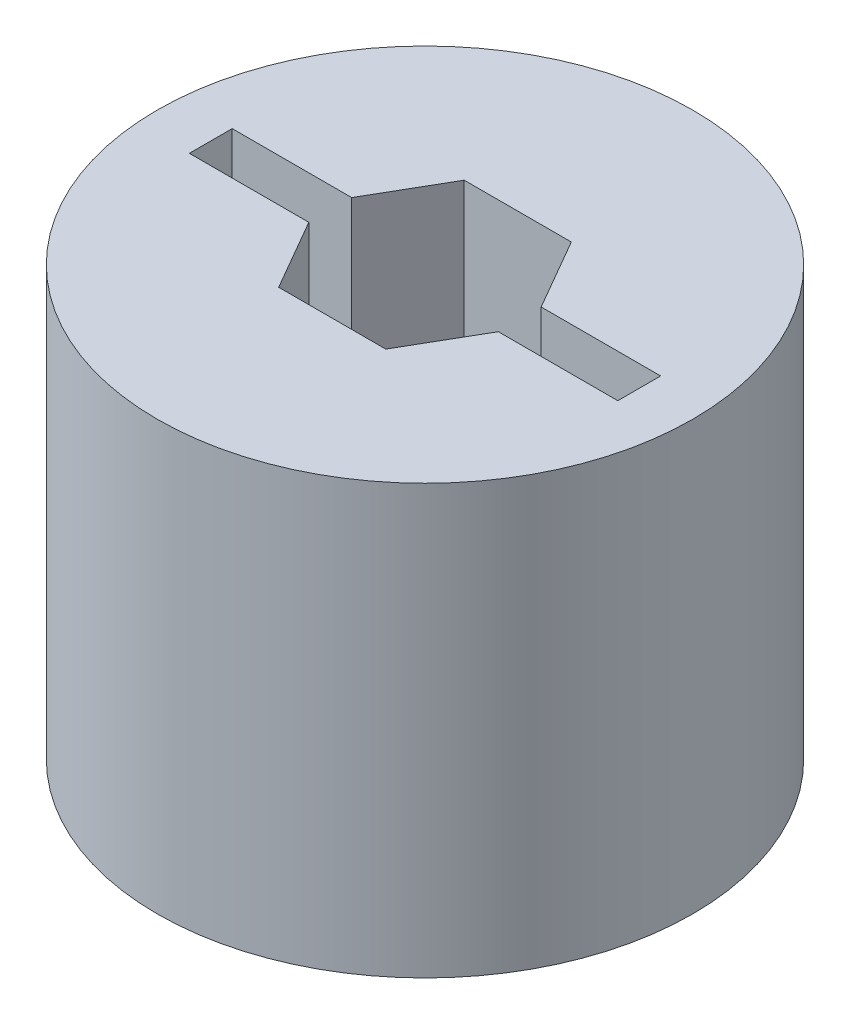
ISO-10303-21;
HEADER;
FILE_DESCRIPTION(('STEP AP214'),'2;1');
FILE_NAME('part.step','',(''),(''),'','','');
FILE_SCHEMA(('AUTOMOTIVE_DESIGN { 1 0 10303 214 1 1 1 1 }'));
ENDSEC;
DATA;
#1=APPLICATION_CONTEXT('core data for automotive mechanical design processes');
#2=APPLICATION_PROTOCOL_DEFINITION('international standard','automotive_design',2000,#1);
#3=PRODUCT_CONTEXT('',#1,'mechanical');
#4=PRODUCT('Part','Part','',(#3));
#5=PRODUCT_RELATED_PRODUCT_CATEGORY('part','',(#4));
#6=PRODUCT_DEFINITION_FORMATION('','',#4);
#7=PRODUCT_DEFINITION_CONTEXT('part definition',#1,'design');
#8=PRODUCT_DEFINITION('design','',#6,#7);
#9=PRODUCT_DEFINITION_SHAPE('','',#8);
#10=(LENGTH_UNIT() NAMED_UNIT(*) SI_UNIT(.MILLI.,.METRE.));
#11=(NAMED_UNIT(*) PLANE_ANGLE_UNIT() SI_UNIT($,.RADIAN.));
#12=(NAMED_UNIT(*) SI_UNIT($,.STERADIAN.) SOLID_ANGLE_UNIT());
#13=UNCERTAINTY_MEASURE_WITH_UNIT(LENGTH_MEASURE(1.E-05),#10,'distance_accuracy_value','');
#14=(GEOMETRIC_REPRESENTATION_CONTEXT(3) GLOBAL_UNCERTAINTY_ASSIGNED_CONTEXT((#13)) GLOBAL_UNIT_ASSIGNED_CONTEXT((#10,
#11,#12)) REPRESENTATION_CONTEXT('',''));
#15=CARTESIAN_POINT('',(0.,0.,0.));
#16=DIRECTION('',(0.,0.,1.));
#17=DIRECTION('',(1.,0.,0.));
#18=AXIS2_PLACEMENT_3D('',#15,#16,#17);
#19=CARTESIAN_POINT('',(0.,25.4,0.));
#20=DIRECTION('',(0.,-1.,0.));
#21=DIRECTION('',(0.,0.,-1.));
#22=AXIS2_PLACEMENT_3D('',#19,#20,#21);
#23=CYLINDRICAL_SURFACE('',#22,15.875);
#24=CARTESIAN_POINT('',(0.,25.4,0.));
#25=DIRECTION('',(0.,1.,0.));
#26=DIRECTION('',(0.,0.,1.));
#27=AXIS2_PLACEMENT_3D('',#24,#25,#26);
#28=CIRCLE('',#27,15.875);
#29=CARTESIAN_POINT('',(0.,25.4,15.875));
#30=VERTEX_POINT('',#29);
#31=EDGE_CURVE('E11',#30,#30,#28,.T.);
#32=ORIENTED_EDGE('',*,*,#31,.F.);
#33=EDGE_LOOP('',(#32));
#34=FACE_BOUND('',#33,.T.);
#35=CARTESIAN_POINT('',(0.,0.,0.));
#36=DIRECTION('',(0.,1.,0.));
#37=DIRECTION('',(0.,0.,1.));
#38=AXIS2_PLACEMENT_3D('',#35,#36,#37);
#39=CIRCLE('',#38,15.875);
#40=CARTESIAN_POINT('',(0.,0.,15.875));
#41=VERTEX_POINT('',#40);
#42=EDGE_CURVE('E35',#41,#41,#39,.T.);
#43=ORIENTED_EDGE('',*,*,#42,.T.);
#44=EDGE_LOOP('',(#43));
#45=FACE_BOUND('',#44,.T.);
#46=ADVANCED_FACE('F32',(#34,#45),#23,.T.);
#47=CARTESIAN_POINT('',(0.,25.4,0.));
#48=DIRECTION('',(0.,1.,0.));
#49=DIRECTION('',(0.,0.,1.));
#50=AXIS2_PLACEMENT_3D('',#47,#48,#49);
#51=PLANE('',#50);
#52=DIRECTION('',(1.,0.,0.));
#53=VECTOR('',#52,1.);
#54=CARTESIAN_POINT('',(0.,25.4,1.27));
#55=LINE('',#54,#53);
#56=CARTESIAN_POINT('',(-12.7,25.4,1.27));
#57=VERTEX_POINT('',#56);
#58=CARTESIAN_POINT('',(-5.61676515812917,25.4,1.27));
#59=VERTEX_POINT('',#58);
#60=EDGE_CURVE('E46',#57,#59,#55,.T.);
#61=ORIENTED_EDGE('',*,*,#60,.F.);
#62=DIRECTION('',(0.,0.,-1.));
#63=VECTOR('',#62,1.);
#64=CARTESIAN_POINT('',(-12.7,25.4,0.));
#65=LINE('',#64,#63);
#66=CARTESIAN_POINT('',(-12.7,25.4,-1.27));
#67=VERTEX_POINT('',#66);
#68=EDGE_CURVE('E138',#57,#67,#65,.T.);
#69=ORIENTED_EDGE('',*,*,#68,.T.);
#70=DIRECTION('',(1.,0.,0.));
#71=VECTOR('',#70,1.);
#72=CARTESIAN_POINT('',(0.,25.4,-1.27));
#73=LINE('',#72,#71);
#74=CARTESIAN_POINT('',(-5.61676515812917,25.4,-1.27));
#75=VERTEX_POINT('',#74);
#76=EDGE_CURVE('E141',#67,#75,#73,.T.);
#77=ORIENTED_EDGE('',*,*,#76,.T.);
#78=DIRECTION('',(-0.5,0.,0.866025403784439));
#79=VECTOR('',#78,1.);
#80=CARTESIAN_POINT('',(-4.7625,25.4,-2.74963065701559));
#81=LINE('',#80,#79);
#82=CARTESIAN_POINT('',(-3.175,25.4,-5.49926131403118));
#83=VERTEX_POINT('',#82);
#84=EDGE_CURVE('E192',#83,#75,#81,.T.);
#85=ORIENTED_EDGE('',*,*,#84,.F.);
#86=DIRECTION('',(-1.,0.,0.));
#87=VECTOR('',#86,1.);
#88=CARTESIAN_POINT('',(0.,25.4,-5.49926131403118));
#89=LINE('',#88,#87);
#90=CARTESIAN_POINT('',(3.175,25.4,-5.49926131403118));
#91=VERTEX_POINT('',#90);
#92=EDGE_CURVE('E189',#91,#83,#89,.T.);
#93=ORIENTED_EDGE('',*,*,#92,.F.);
#94=DIRECTION('',(-0.5,0.,-0.866025403784439));
#95=VECTOR('',#94,1.);
#96=CARTESIAN_POINT('',(4.7625,25.4,-2.74963065701559));
#97=LINE('',#96,#95);
#98=CARTESIAN_POINT('',(5.61676515812917,25.4,-1.27));
#99=VERTEX_POINT('',#98);
#100=EDGE_CURVE('E186',#99,#91,#97,.T.);
#101=ORIENTED_EDGE('',*,*,#100,.F.);
#102=DIRECTION('',(1.,0.,0.));
#103=VECTOR('',#102,1.);
#104=CARTESIAN_POINT('',(0.,25.4,-1.27));
#105=LINE('',#104,#103);
#106=CARTESIAN_POINT('',(12.7,25.4,-1.27));
#107=VERTEX_POINT('',#106);
#108=EDGE_CURVE('E183',#99,#107,#105,.T.);
#109=ORIENTED_EDGE('',*,*,#108,.T.);
#110=DIRECTION('',(0.,0.,-1.));
#111=VECTOR('',#110,1.);
#112=CARTESIAN_POINT('',(12.7,25.4,0.));
#113=LINE('',#112,#111);
#114=CARTESIAN_POINT('',(12.7,25.4,1.27));
#115=VERTEX_POINT('',#114);
#116=EDGE_CURVE('E180',#115,#107,#113,.T.);
#117=ORIENTED_EDGE('',*,*,#116,.F.);
#118=DIRECTION('',(1.,0.,0.));
#119=VECTOR('',#118,1.);
#120=CARTESIAN_POINT('',(0.,25.4,1.27));
#121=LINE('',#120,#119);
#122=CARTESIAN_POINT('',(5.61676515812917,25.4,1.27));
#123=VERTEX_POINT('',#122);
#124=EDGE_CURVE('E177',#123,#115,#121,.T.);
#125=ORIENTED_EDGE('',*,*,#124,.F.);
#126=DIRECTION('',(0.5,0.,-0.866025403784439));
#127=VECTOR('',#126,1.);
#128=CARTESIAN_POINT('',(4.7625,25.4,2.74963065701559));
#129=LINE('',#128,#127);
#130=CARTESIAN_POINT('',(3.175,25.4,5.49926131403118));
#131=VERTEX_POINT('',#130);
#132=EDGE_CURVE('E174',#131,#123,#129,.T.);
#133=ORIENTED_EDGE('',*,*,#132,.F.);
#134=DIRECTION('',(1.,0.,0.));
#135=VECTOR('',#134,1.);
#136=CARTESIAN_POINT('',(0.,25.4,5.49926131403118));
#137=LINE('',#136,#135);
#138=CARTESIAN_POINT('',(-3.175,25.4,5.49926131403118));
#139=VERTEX_POINT('',#138);
#140=EDGE_CURVE('E171',#139,#131,#137,.T.);
#141=ORIENTED_EDGE('',*,*,#140,.F.);
#142=DIRECTION('',(0.5,0.,0.866025403784439));
#143=VECTOR('',#142,1.);
#144=CARTESIAN_POINT('',(-4.7625,25.4,2.74963065701559));
#145=LINE('',#144,#143);
#146=EDGE_CURVE('E169',#59,#139,#145,.T.);
#147=ORIENTED_EDGE('',*,*,#146,.F.);
#148=EDGE_LOOP('',(#61,#69,#77,#85,#93,#101,#109,#117,#125,#133,#141,#147));
#149=FACE_BOUND('',#148,.T.);
#150=ORIENTED_EDGE('',*,*,#31,.T.);
#151=EDGE_LOOP('',(#150));
#152=FACE_BOUND('',#151,.T.);
#153=ADVANCED_FACE('F221',(#149,#152),#51,.T.);
#154=CARTESIAN_POINT('',(0.,0.,0.));
#155=DIRECTION('',(0.,1.,0.));
#156=DIRECTION('',(0.,0.,1.));
#157=AXIS2_PLACEMENT_3D('',#154,#155,#156);
#158=PLANE('',#157);
#159=DIRECTION('',(0.,0.,-1.));
#160=VECTOR('',#159,1.);
#161=CARTESIAN_POINT('',(-12.7,0.,0.));
#162=LINE('',#161,#160);
#163=CARTESIAN_POINT('',(-12.7,0.,1.27));
#164=VERTEX_POINT('',#163);
#165=CARTESIAN_POINT('',(-12.7,0.,-1.27));
#166=VERTEX_POINT('',#165);
#167=EDGE_CURVE('E128',#164,#166,#162,.T.);
#168=ORIENTED_EDGE('',*,*,#167,.F.);
#169=DIRECTION('',(1.,0.,0.));
#170=VECTOR('',#169,1.);
#171=CARTESIAN_POINT('',(0.,0.,1.27));
#172=LINE('',#171,#170);
#173=CARTESIAN_POINT('',(-5.61676515812917,0.,1.27));
#174=VERTEX_POINT('',#173);
#175=EDGE_CURVE('E122',#164,#174,#172,.T.);
#176=ORIENTED_EDGE('',*,*,#175,.T.);
#177=DIRECTION('',(0.5,0.,0.866025403784439));
#178=VECTOR('',#177,1.);
#179=CARTESIAN_POINT('',(-4.7625,0.,2.74963065701559));
#180=LINE('',#179,#178);
#181=CARTESIAN_POINT('',(-3.175,0.,5.49926131403118));
#182=VERTEX_POINT('',#181);
#183=EDGE_CURVE('E131',#174,#182,#180,.T.);
#184=ORIENTED_EDGE('',*,*,#183,.T.);
#185=DIRECTION('',(1.,0.,0.));
#186=VECTOR('',#185,1.);
#187=CARTESIAN_POINT('',(0.,0.,5.49926131403118));
#188=LINE('',#187,#186);
#189=CARTESIAN_POINT('',(3.175,0.,5.49926131403118));
#190=VERTEX_POINT('',#189);
#191=EDGE_CURVE('E54',#182,#190,#188,.T.);
#192=ORIENTED_EDGE('',*,*,#191,.T.);
#193=DIRECTION('',(0.5,0.,-0.866025403784439));
#194=VECTOR('',#193,1.);
#195=CARTESIAN_POINT('',(4.7625,0.,2.74963065701559));
#196=LINE('',#195,#194);
#197=CARTESIAN_POINT('',(5.61676515812917,0.,1.27));
#198=VERTEX_POINT('',#197);
#199=EDGE_CURVE('E145',#190,#198,#196,.T.);
#200=ORIENTED_EDGE('',*,*,#199,.T.);
#201=DIRECTION('',(1.,0.,0.));
#202=VECTOR('',#201,1.);
#203=CARTESIAN_POINT('',(0.,0.,1.27));
#204=LINE('',#203,#202);
#205=CARTESIAN_POINT('',(12.7,0.,1.27));
#206=VERTEX_POINT('',#205);
#207=EDGE_CURVE('E148',#198,#206,#204,.T.);
#208=ORIENTED_EDGE('',*,*,#207,.T.);
#209=DIRECTION('',(0.,0.,-1.));
#210=VECTOR('',#209,1.);
#211=CARTESIAN_POINT('',(12.7,0.,0.));
#212=LINE('',#211,#210);
#213=CARTESIAN_POINT('',(12.7,0.,-1.27));
#214=VERTEX_POINT('',#213);
#215=EDGE_CURVE('E151',#206,#214,#212,.T.);
#216=ORIENTED_EDGE('',*,*,#215,.T.);
#217=DIRECTION('',(1.,0.,0.));
#218=VECTOR('',#217,1.);
#219=CARTESIAN_POINT('',(0.,0.,-1.27));
#220=LINE('',#219,#218);
#221=CARTESIAN_POINT('',(5.61676515812917,0.,-1.27));
#222=VERTEX_POINT('',#221);
#223=EDGE_CURVE('E154',#222,#214,#220,.T.);
#224=ORIENTED_EDGE('',*,*,#223,.F.);
#225=DIRECTION('',(-0.5,0.,-0.866025403784439));
#226=VECTOR('',#225,1.);
#227=CARTESIAN_POINT('',(4.7625,0.,-2.74963065701559));
#228=LINE('',#227,#226);
#229=CARTESIAN_POINT('',(3.175,0.,-5.49926131403118));
#230=VERTEX_POINT('',#229);
#231=EDGE_CURVE('E156',#222,#230,#228,.T.);
#232=ORIENTED_EDGE('',*,*,#231,.T.);
#233=DIRECTION('',(-1.,0.,0.));
#234=VECTOR('',#233,1.);
#235=CARTESIAN_POINT('',(0.,0.,-5.49926131403118));
#236=LINE('',#235,#234);
#237=CARTESIAN_POINT('',(-3.175,0.,-5.49926131403118));
#238=VERTEX_POINT('',#237);
#239=EDGE_CURVE('E159',#230,#238,#236,.T.);
#240=ORIENTED_EDGE('',*,*,#239,.T.);
#241=DIRECTION('',(-0.5,0.,0.866025403784439));
#242=VECTOR('',#241,1.);
#243=CARTESIAN_POINT('',(-4.7625,0.,-2.74963065701559));
#244=LINE('',#243,#242);
#245=CARTESIAN_POINT('',(-5.61676515812917,0.,-1.27));
#246=VERTEX_POINT('',#245);
#247=EDGE_CURVE('E162',#238,#246,#244,.T.);
#248=ORIENTED_EDGE('',*,*,#247,.T.);
#249=DIRECTION('',(1.,0.,0.));
#250=VECTOR('',#249,1.);
#251=CARTESIAN_POINT('',(0.,0.,-1.27));
#252=LINE('',#251,#250);
#253=EDGE_CURVE('E165',#166,#246,#252,.T.);
#254=ORIENTED_EDGE('',*,*,#253,.F.);
#255=EDGE_LOOP('',(#168,#176,#184,#192,#200,#208,#216,#224,#232,#240,#248,#254));
#256=FACE_BOUND('',#255,.T.);
#257=ORIENTED_EDGE('',*,*,#42,.F.);
#258=EDGE_LOOP('',(#257));
#259=FACE_BOUND('',#258,.T.);
#260=ADVANCED_FACE('F135',(#256,#259),#158,.F.);
#261=CARTESIAN_POINT('',(0.,0.,1.27));
#262=DIRECTION('',(0.,0.,1.));
#263=DIRECTION('',(1.,0.,0.));
#264=AXIS2_PLACEMENT_3D('',#261,#262,#263);
#265=PLANE('',#264);
#266=ORIENTED_EDGE('',*,*,#60,.T.);
#267=DIRECTION('',(0.,1.,0.));
#268=VECTOR('',#267,1.);
#269=CARTESIAN_POINT('',(-5.61676515812917,0.,1.27));
#270=LINE('',#269,#268);
#271=EDGE_CURVE('E118',#174,#59,#270,.T.);
#272=ORIENTED_EDGE('',*,*,#271,.F.);
#273=ORIENTED_EDGE('',*,*,#175,.F.);
#274=DIRECTION('',(0.,1.,0.));
#275=VECTOR('',#274,1.);
#276=CARTESIAN_POINT('',(-12.7,0.,1.27));
#277=LINE('',#276,#275);
#278=EDGE_CURVE('E197',#164,#57,#277,.T.);
#279=ORIENTED_EDGE('',*,*,#278,.T.);
#280=EDGE_LOOP('',(#266,#272,#273,#279));
#281=FACE_BOUND('',#280,.T.);
#282=ADVANCED_FACE('F120',(#281),#265,.F.);
#283=CARTESIAN_POINT('',(-12.7,0.,0.));
#284=DIRECTION('',(1.,0.,0.));
#285=DIRECTION('',(0.,0.,-1.));
#286=AXIS2_PLACEMENT_3D('',#283,#284,#285);
#287=PLANE('',#286);
#288=ORIENTED_EDGE('',*,*,#68,.F.);
#289=ORIENTED_EDGE('',*,*,#278,.F.);
#290=ORIENTED_EDGE('',*,*,#167,.T.);
#291=DIRECTION('',(0.,1.,0.));
#292=VECTOR('',#291,1.);
#293=CARTESIAN_POINT('',(-12.7,0.,-1.27));
#294=LINE('',#293,#292);
#295=EDGE_CURVE('E199',#166,#67,#294,.T.);
#296=ORIENTED_EDGE('',*,*,#295,.T.);
#297=EDGE_LOOP('',(#288,#289,#290,#296));
#298=FACE_BOUND('',#297,.T.);
#299=ADVANCED_FACE('F258',(#298),#287,.T.);
#300=CARTESIAN_POINT('',(0.,0.,-1.27));
#301=DIRECTION('',(0.,0.,1.));
#302=DIRECTION('',(1.,0.,0.));
#303=AXIS2_PLACEMENT_3D('',#300,#301,#302);
#304=PLANE('',#303);
#305=ORIENTED_EDGE('',*,*,#76,.F.);
#306=ORIENTED_EDGE('',*,*,#295,.F.);
#307=ORIENTED_EDGE('',*,*,#253,.T.);
#308=DIRECTION('',(0.,1.,0.));
#309=VECTOR('',#308,1.);
#310=CARTESIAN_POINT('',(-5.61676515812917,0.,-1.27));
#311=LINE('',#310,#309);
#312=EDGE_CURVE('E201',#246,#75,#311,.T.);
#313=ORIENTED_EDGE('',*,*,#312,.T.);
#314=EDGE_LOOP('',(#305,#306,#307,#313));
#315=FACE_BOUND('',#314,.T.);
#316=ADVANCED_FACE('F255',(#315),#304,.T.);
#317=CARTESIAN_POINT('',(-4.7625,0.,-2.74963065701559));
#318=DIRECTION('',(-0.866025403784439,0.,-0.5));
#319=DIRECTION('',(-0.5,0.,0.866025403784439));
#320=AXIS2_PLACEMENT_3D('',#317,#318,#319);
#321=PLANE('',#320);
#322=ORIENTED_EDGE('',*,*,#84,.T.);
#323=ORIENTED_EDGE('',*,*,#312,.F.);
#324=ORIENTED_EDGE('',*,*,#247,.F.);
#325=DIRECTION('',(0.,1.,0.));
#326=VECTOR('',#325,1.);
#327=CARTESIAN_POINT('',(-3.175,0.,-5.49926131403118));
#328=LINE('',#327,#326);
#329=EDGE_CURVE('E203',#238,#83,#328,.T.);
#330=ORIENTED_EDGE('',*,*,#329,.T.);
#331=EDGE_LOOP('',(#322,#323,#324,#330));
#332=FACE_BOUND('',#331,.T.);
#333=ADVANCED_FACE('F251',(#332),#321,.F.);
#334=CARTESIAN_POINT('',(0.,0.,-5.49926131403118));
#335=DIRECTION('',(0.,0.,-1.));
#336=DIRECTION('',(-1.,0.,0.));
#337=AXIS2_PLACEMENT_3D('',#334,#335,#336);
#338=PLANE('',#337);
#339=ORIENTED_EDGE('',*,*,#92,.T.);
#340=ORIENTED_EDGE('',*,*,#329,.F.);
#341=ORIENTED_EDGE('',*,*,#239,.F.);
#342=DIRECTION('',(0.,1.,0.));
#343=VECTOR('',#342,1.);
#344=CARTESIAN_POINT('',(3.175,0.,-5.49926131403118));
#345=LINE('',#344,#343);
#346=EDGE_CURVE('E205',#230,#91,#345,.T.);
#347=ORIENTED_EDGE('',*,*,#346,.T.);
#348=EDGE_LOOP('',(#339,#340,#341,#347));
#349=FACE_BOUND('',#348,.T.);
#350=ADVANCED_FACE('F246',(#349),#338,.F.);
#351=CARTESIAN_POINT('',(4.7625,0.,-2.74963065701559));
#352=DIRECTION('',(0.866025403784438,0.,-0.5));
#353=DIRECTION('',(-0.5,0.,-0.866025403784439));
#354=AXIS2_PLACEMENT_3D('',#351,#352,#353);
#355=PLANE('',#354);
#356=ORIENTED_EDGE('',*,*,#100,.T.);
#357=ORIENTED_EDGE('',*,*,#346,.F.);
#358=ORIENTED_EDGE('',*,*,#231,.F.);
#359=DIRECTION('',(0.,1.,0.));
#360=VECTOR('',#359,1.);
#361=CARTESIAN_POINT('',(5.61676515812917,0.,-1.27));
#362=LINE('',#361,#360);
#363=EDGE_CURVE('E207',#222,#99,#362,.T.);
#364=ORIENTED_EDGE('',*,*,#363,.T.);
#365=EDGE_LOOP('',(#356,#357,#358,#364));
#366=FACE_BOUND('',#365,.T.);
#367=ADVANCED_FACE('F243',(#366),#355,.F.);
#368=CARTESIAN_POINT('',(0.,0.,-1.27));
#369=DIRECTION('',(0.,0.,1.));
#370=DIRECTION('',(1.,0.,0.));
#371=AXIS2_PLACEMENT_3D('',#368,#369,#370);
#372=PLANE('',#371);
#373=ORIENTED_EDGE('',*,*,#108,.F.);
#374=ORIENTED_EDGE('',*,*,#363,.F.);
#375=ORIENTED_EDGE('',*,*,#223,.T.);
#376=DIRECTION('',(0.,1.,0.));
#377=VECTOR('',#376,1.);
#378=CARTESIAN_POINT('',(12.7,0.,-1.27));
#379=LINE('',#378,#377);
#380=EDGE_CURVE('E209',#214,#107,#379,.T.);
#381=ORIENTED_EDGE('',*,*,#380,.T.);
#382=EDGE_LOOP('',(#373,#374,#375,#381));
#383=FACE_BOUND('',#382,.T.);
#384=ADVANCED_FACE('F238',(#383),#372,.T.);
#385=CARTESIAN_POINT('',(12.7,0.,0.));
#386=DIRECTION('',(1.,0.,0.));
#387=DIRECTION('',(0.,0.,-1.));
#388=AXIS2_PLACEMENT_3D('',#385,#386,#387);
#389=PLANE('',#388);
#390=ORIENTED_EDGE('',*,*,#116,.T.);
#391=ORIENTED_EDGE('',*,*,#380,.F.);
#392=ORIENTED_EDGE('',*,*,#215,.F.);
#393=DIRECTION('',(0.,1.,0.));
#394=VECTOR('',#393,1.);
#395=CARTESIAN_POINT('',(12.7,0.,1.27));
#396=LINE('',#395,#394);
#397=EDGE_CURVE('E211',#206,#115,#396,.T.);
#398=ORIENTED_EDGE('',*,*,#397,.T.);
#399=EDGE_LOOP('',(#390,#391,#392,#398));
#400=FACE_BOUND('',#399,.T.);
#401=ADVANCED_FACE('F235',(#400),#389,.F.);
#402=CARTESIAN_POINT('',(0.,0.,1.27));
#403=DIRECTION('',(0.,0.,1.));
#404=DIRECTION('',(1.,0.,0.));
#405=AXIS2_PLACEMENT_3D('',#402,#403,#404);
#406=PLANE('',#405);
#407=ORIENTED_EDGE('',*,*,#124,.T.);
#408=ORIENTED_EDGE('',*,*,#397,.F.);
#409=ORIENTED_EDGE('',*,*,#207,.F.);
#410=DIRECTION('',(0.,1.,0.));
#411=VECTOR('',#410,1.);
#412=CARTESIAN_POINT('',(5.61676515812917,0.,1.27));
#413=LINE('',#412,#411);
#414=EDGE_CURVE('E213',#198,#123,#413,.T.);
#415=ORIENTED_EDGE('',*,*,#414,.T.);
#416=EDGE_LOOP('',(#407,#408,#409,#415));
#417=FACE_BOUND('',#416,.T.);
#418=ADVANCED_FACE('F232',(#417),#406,.F.);
#419=CARTESIAN_POINT('',(4.7625,0.,2.74963065701559));
#420=DIRECTION('',(0.866025403784439,0.,0.5));
#421=DIRECTION('',(0.5,0.,-0.866025403784439));
#422=AXIS2_PLACEMENT_3D('',#419,#420,#421);
#423=PLANE('',#422);
#424=ORIENTED_EDGE('',*,*,#132,.T.);
#425=ORIENTED_EDGE('',*,*,#414,.F.);
#426=ORIENTED_EDGE('',*,*,#199,.F.);
#427=DIRECTION('',(0.,1.,0.));
#428=VECTOR('',#427,1.);
#429=CARTESIAN_POINT('',(3.175,0.,5.49926131403118));
#430=LINE('',#429,#428);
#431=EDGE_CURVE('E215',#190,#131,#430,.T.);
#432=ORIENTED_EDGE('',*,*,#431,.T.);
#433=EDGE_LOOP('',(#424,#425,#426,#432));
#434=FACE_BOUND('',#433,.T.);
#435=ADVANCED_FACE('F226',(#434),#423,.F.);
#436=CARTESIAN_POINT('',(0.,0.,5.49926131403118));
#437=DIRECTION('',(0.,0.,1.));
#438=DIRECTION('',(1.,0.,0.));
#439=AXIS2_PLACEMENT_3D('',#436,#437,#438);
#440=PLANE('',#439);
#441=ORIENTED_EDGE('',*,*,#140,.T.);
#442=ORIENTED_EDGE('',*,*,#431,.F.);
#443=ORIENTED_EDGE('',*,*,#191,.F.);
#444=DIRECTION('',(0.,1.,0.));
#445=VECTOR('',#444,1.);
#446=CARTESIAN_POINT('',(-3.175,0.,5.49926131403118));
#447=LINE('',#446,#445);
#448=EDGE_CURVE('E127',#182,#139,#447,.T.);
#449=ORIENTED_EDGE('',*,*,#448,.T.);
#450=EDGE_LOOP('',(#441,#442,#443,#449));
#451=FACE_BOUND('',#450,.T.);
#452=ADVANCED_FACE('F217',(#451),#440,.F.);
#453=CARTESIAN_POINT('',(-4.7625,0.,2.74963065701559));
#454=DIRECTION('',(-0.866025403784439,0.,0.5));
#455=DIRECTION('',(0.5,0.,0.866025403784439));
#456=AXIS2_PLACEMENT_3D('',#453,#454,#455);
#457=PLANE('',#456);
#458=ORIENTED_EDGE('',*,*,#146,.T.);
#459=ORIENTED_EDGE('',*,*,#448,.F.);
#460=ORIENTED_EDGE('',*,*,#183,.F.);
#461=ORIENTED_EDGE('',*,*,#271,.T.);
#462=EDGE_LOOP('',(#458,#459,#460,#461));
#463=FACE_BOUND('',#462,.T.);
#464=ADVANCED_FACE('F132',(#463),#457,.F.);
#465=CLOSED_SHELL('',(#46,#153,#260,#282,#299,#316,#333,#350,#367,#384,#401,#418,#435,#452,#464));
#466=MANIFOLD_SOLID_BREP('B2',#465);
#467=ADVANCED_BREP_SHAPE_REPRESENTATION('',(#18,#466),#14);
#468=SHAPE_DEFINITION_REPRESENTATION(#9,#467);
ENDSEC;
END-ISO-10303-21;
